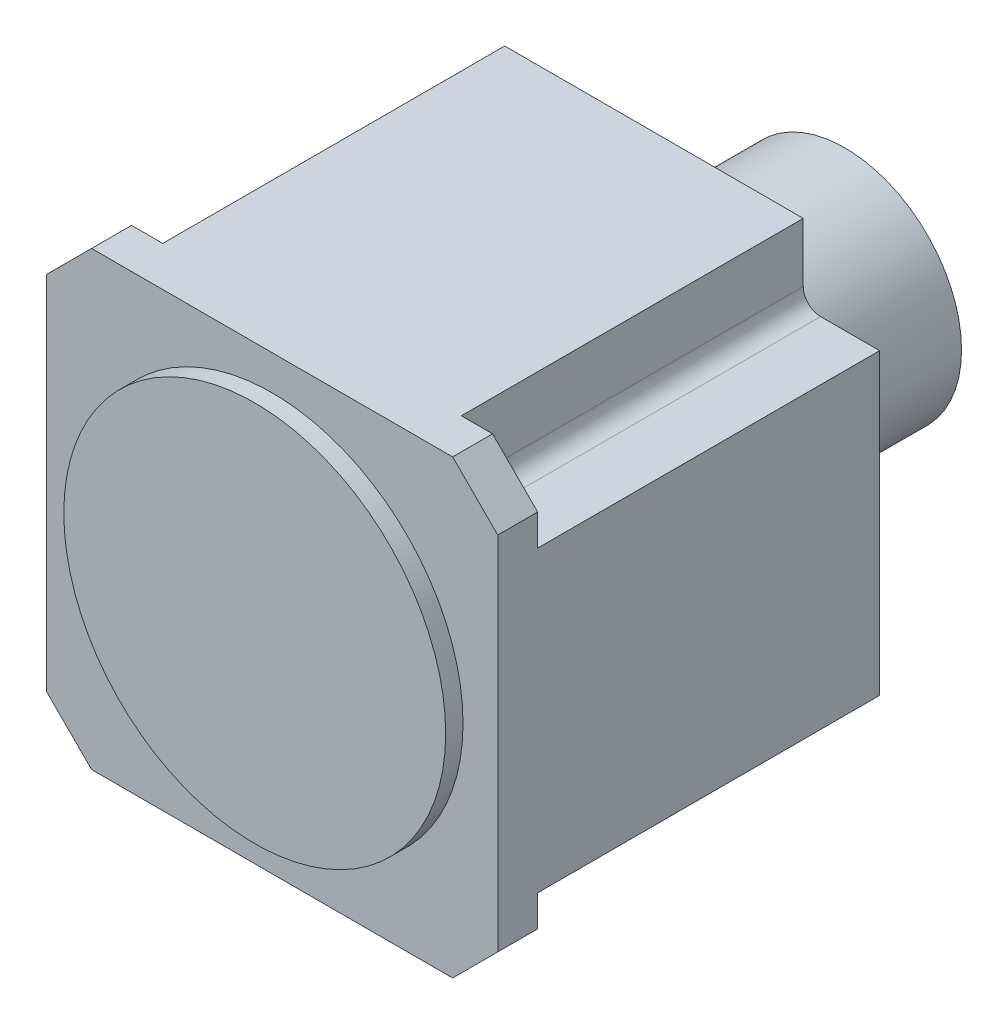
ISO-10303-21;
HEADER;
FILE_DESCRIPTION(('STEP AP214'),'2;1');
FILE_NAME('part.step','',(''),(''),'','','');
FILE_SCHEMA(('AUTOMOTIVE_DESIGN { 1 0 10303 214 1 1 1 1 }'));
ENDSEC;
DATA;
#1=APPLICATION_CONTEXT('core data for automotive mechanical design processes');
#2=APPLICATION_PROTOCOL_DEFINITION('international standard','automotive_design',2000,#1);
#3=PRODUCT_CONTEXT('',#1,'mechanical');
#4=PRODUCT('Part','Part','',(#3));
#5=PRODUCT_RELATED_PRODUCT_CATEGORY('part','',(#4));
#6=PRODUCT_DEFINITION_FORMATION('','',#4);
#7=PRODUCT_DEFINITION_CONTEXT('part definition',#1,'design');
#8=PRODUCT_DEFINITION('design','',#6,#7);
#9=PRODUCT_DEFINITION_SHAPE('','',#8);
#10=(LENGTH_UNIT() NAMED_UNIT(*) SI_UNIT(.MILLI.,.METRE.));
#11=(NAMED_UNIT(*) PLANE_ANGLE_UNIT() SI_UNIT($,.RADIAN.));
#12=(NAMED_UNIT(*) SI_UNIT($,.STERADIAN.) SOLID_ANGLE_UNIT());
#13=UNCERTAINTY_MEASURE_WITH_UNIT(LENGTH_MEASURE(1.E-05),#10,'distance_accuracy_value','');
#14=(GEOMETRIC_REPRESENTATION_CONTEXT(3) GLOBAL_UNCERTAINTY_ASSIGNED_CONTEXT((#13)) GLOBAL_UNIT_ASSIGNED_CONTEXT((#10,
#11,#12)) REPRESENTATION_CONTEXT('',''));
#15=CARTESIAN_POINT('',(0.,0.,0.));
#16=DIRECTION('',(0.,0.,1.));
#17=DIRECTION('',(1.,0.,0.));
#18=AXIS2_PLACEMENT_3D('',#15,#16,#17);
#19=CARTESIAN_POINT('',(0.,0.,0.));
#20=DIRECTION('',(0.,0.,1.));
#21=DIRECTION('',(1.,0.,0.));
#22=AXIS2_PLACEMENT_3D('',#19,#20,#21);
#23=PLANE('',#22);
#24=DIRECTION('',(0.,1.,0.));
#25=VECTOR('',#24,1.);
#26=CARTESIAN_POINT('',(-43.,0.,0.));
#27=LINE('',#26,#25);
#28=CARTESIAN_POINT('',(-43.,48.,0.));
#29=VERTEX_POINT('',#28);
#30=CARTESIAN_POINT('',(-43.,65.,0.));
#31=VERTEX_POINT('',#30);
#32=EDGE_CURVE('E272',#29,#31,#27,.T.);
#33=ORIENTED_EDGE('',*,*,#32,.F.);
#34=CARTESIAN_POINT('',(-48.,48.,0.));
#35=DIRECTION('',(0.,0.,1.));
#36=DIRECTION('',(1.,0.,0.));
#37=AXIS2_PLACEMENT_3D('',#34,#35,#36);
#38=CIRCLE('',#37,5.);
#39=CARTESIAN_POINT('',(-48.,43.,0.));
#40=VERTEX_POINT('',#39);
#41=EDGE_CURVE('E380',#29,#40,#38,.F.);
#42=ORIENTED_EDGE('',*,*,#41,.T.);
#43=DIRECTION('',(1.,0.,0.));
#44=VECTOR('',#43,1.);
#45=CARTESIAN_POINT('',(0.,43.,0.));
#46=LINE('',#45,#44);
#47=CARTESIAN_POINT('',(-65.,43.,0.));
#48=VERTEX_POINT('',#47);
#49=EDGE_CURVE('E269',#48,#40,#46,.T.);
#50=ORIENTED_EDGE('',*,*,#49,.F.);
#51=DIRECTION('',(0.,-1.,0.));
#52=VECTOR('',#51,1.);
#53=CARTESIAN_POINT('',(-65.,0.,0.));
#54=LINE('',#53,#52);
#55=CARTESIAN_POINT('',(-65.,52.,0.));
#56=VERTEX_POINT('',#55);
#57=EDGE_CURVE('E334',#56,#48,#54,.T.);
#58=ORIENTED_EDGE('',*,*,#57,.F.);
#59=DIRECTION('',(0.707106781186548,0.707106781186548,0.));
#60=VECTOR('',#59,1.);
#61=CARTESIAN_POINT('',(-58.5,58.5,0.));
#62=LINE('',#61,#60);
#63=CARTESIAN_POINT('',(-52.,65.,0.));
#64=VERTEX_POINT('',#63);
#65=EDGE_CURVE('E330',#56,#64,#62,.T.);
#66=ORIENTED_EDGE('',*,*,#65,.T.);
#67=DIRECTION('',(-1.,0.,0.));
#68=VECTOR('',#67,1.);
#69=CARTESIAN_POINT('',(0.,65.,0.));
#70=LINE('',#69,#68);
#71=EDGE_CURVE('E326',#31,#64,#70,.T.);
#72=ORIENTED_EDGE('',*,*,#71,.F.);
#73=EDGE_LOOP('',(#33,#42,#50,#58,#66,#72));
#74=FACE_BOUND('',#73,.T.);
#75=ADVANCED_FACE('F41',(#74),#23,.F.);
#76=DIRECTION('',(1.,0.,0.));
#77=VECTOR('',#76,1.);
#78=CARTESIAN_POINT('',(0.,-43.,0.));
#79=LINE('',#78,#77);
#80=CARTESIAN_POINT('',(-65.,-43.,0.));
#81=VERTEX_POINT('',#80);
#82=CARTESIAN_POINT('',(-48.,-43.,0.));
#83=VERTEX_POINT('',#82);
#84=EDGE_CURVE('E266',#81,#83,#79,.T.);
#85=ORIENTED_EDGE('',*,*,#84,.T.);
#86=CARTESIAN_POINT('',(-48.,-48.,0.));
#87=DIRECTION('',(0.,0.,1.));
#88=DIRECTION('',(1.,0.,0.));
#89=AXIS2_PLACEMENT_3D('',#86,#87,#88);
#90=CIRCLE('',#89,5.);
#91=CARTESIAN_POINT('',(-43.,-48.,0.));
#92=VERTEX_POINT('',#91);
#93=EDGE_CURVE('E373',#83,#92,#90,.F.);
#94=ORIENTED_EDGE('',*,*,#93,.T.);
#95=DIRECTION('',(0.,1.,0.));
#96=VECTOR('',#95,1.);
#97=CARTESIAN_POINT('',(-43.,0.,0.));
#98=LINE('',#97,#96);
#99=CARTESIAN_POINT('',(-43.,-65.,0.));
#100=VERTEX_POINT('',#99);
#101=EDGE_CURVE('E263',#100,#92,#98,.T.);
#102=ORIENTED_EDGE('',*,*,#101,.F.);
#103=DIRECTION('',(-1.,0.,0.));
#104=VECTOR('',#103,1.);
#105=CARTESIAN_POINT('',(0.,-65.,0.));
#106=LINE('',#105,#104);
#107=CARTESIAN_POINT('',(-52.0000000000001,-65.,0.));
#108=VERTEX_POINT('',#107);
#109=EDGE_CURVE('E340',#100,#108,#106,.T.);
#110=ORIENTED_EDGE('',*,*,#109,.T.);
#111=DIRECTION('',(-0.707106781186547,0.707106781186548,0.));
#112=VECTOR('',#111,1.);
#113=CARTESIAN_POINT('',(-58.5,-58.5,0.));
#114=LINE('',#113,#112);
#115=CARTESIAN_POINT('',(-65.,-52.0000000000001,0.));
#116=VERTEX_POINT('',#115);
#117=EDGE_CURVE('E337',#108,#116,#114,.T.);
#118=ORIENTED_EDGE('',*,*,#117,.T.);
#119=EDGE_CURVE('E333',#81,#116,#54,.T.);
#120=ORIENTED_EDGE('',*,*,#119,.F.);
#121=EDGE_LOOP('',(#85,#94,#102,#110,#118,#120));
#122=FACE_BOUND('',#121,.T.);
#123=ADVANCED_FACE('F472',(#122),#23,.F.);
#124=DIRECTION('',(0.,1.,0.));
#125=VECTOR('',#124,1.);
#126=CARTESIAN_POINT('',(43.,0.,0.));
#127=LINE('',#126,#125);
#128=CARTESIAN_POINT('',(43.,-65.,0.));
#129=VERTEX_POINT('',#128);
#130=CARTESIAN_POINT('',(43.,-48.,0.));
#131=VERTEX_POINT('',#130);
#132=EDGE_CURVE('E260',#129,#131,#127,.T.);
#133=ORIENTED_EDGE('',*,*,#132,.T.);
#134=CARTESIAN_POINT('',(48.,-48.,0.));
#135=DIRECTION('',(0.,0.,1.));
#136=DIRECTION('',(1.,0.,0.));
#137=AXIS2_PLACEMENT_3D('',#134,#135,#136);
#138=CIRCLE('',#137,5.);
#139=CARTESIAN_POINT('',(48.,-43.,0.));
#140=VERTEX_POINT('',#139);
#141=EDGE_CURVE('E366',#131,#140,#138,.F.);
#142=ORIENTED_EDGE('',*,*,#141,.T.);
#143=DIRECTION('',(1.,0.,0.));
#144=VECTOR('',#143,1.);
#145=CARTESIAN_POINT('',(0.,-43.,0.));
#146=LINE('',#145,#144);
#147=CARTESIAN_POINT('',(65.,-43.,0.));
#148=VERTEX_POINT('',#147);
#149=EDGE_CURVE('E258',#140,#148,#146,.T.);
#150=ORIENTED_EDGE('',*,*,#149,.T.);
#151=DIRECTION('',(0.,-1.,0.));
#152=VECTOR('',#151,1.);
#153=CARTESIAN_POINT('',(65.,0.,0.));
#154=LINE('',#153,#152);
#155=CARTESIAN_POINT('',(65.,-52.,0.));
#156=VERTEX_POINT('',#155);
#157=EDGE_CURVE('E294',#148,#156,#154,.T.);
#158=ORIENTED_EDGE('',*,*,#157,.T.);
#159=DIRECTION('',(0.707106781186548,0.707106781186548,0.));
#160=VECTOR('',#159,1.);
#161=CARTESIAN_POINT('',(58.5,-58.5,0.));
#162=LINE('',#161,#160);
#163=CARTESIAN_POINT('',(52.,-65.,0.));
#164=VERTEX_POINT('',#163);
#165=EDGE_CURVE('E304',#164,#156,#162,.T.);
#166=ORIENTED_EDGE('',*,*,#165,.F.);
#167=EDGE_CURVE('E341',#164,#129,#106,.T.);
#168=ORIENTED_EDGE('',*,*,#167,.T.);
#169=EDGE_LOOP('',(#133,#142,#150,#158,#166,#168));
#170=FACE_BOUND('',#169,.T.);
#171=ADVANCED_FACE('F454',(#170),#23,.F.);
#172=CARTESIAN_POINT('',(65.,0.,11.5));
#173=DIRECTION('',(1.,0.,0.));
#174=DIRECTION('',(0.,1.,0.));
#175=AXIS2_PLACEMENT_3D('',#172,#173,#174);
#176=PLANE('',#175);
#177=CARTESIAN_POINT('',(65.,52.,0.));
#178=VERTEX_POINT('',#177);
#179=CARTESIAN_POINT('',(65.,43.,0.));
#180=VERTEX_POINT('',#179);
#181=EDGE_CURVE('E322',#178,#180,#154,.T.);
#182=ORIENTED_EDGE('',*,*,#181,.F.);
#183=DIRECTION('',(0.,0.,-1.));
#184=VECTOR('',#183,1.);
#185=CARTESIAN_POINT('',(65.,52.,11.5));
#186=LINE('',#185,#184);
#187=CARTESIAN_POINT('',(65.,52.,11.5));
#188=VERTEX_POINT('',#187);
#189=EDGE_CURVE('E299',#188,#178,#186,.T.);
#190=ORIENTED_EDGE('',*,*,#189,.F.);
#191=DIRECTION('',(0.,-1.,0.));
#192=VECTOR('',#191,1.);
#193=CARTESIAN_POINT('',(65.,0.,11.5));
#194=LINE('',#193,#192);
#195=CARTESIAN_POINT('',(65.,-52.,11.5));
#196=VERTEX_POINT('',#195);
#197=EDGE_CURVE('E300',#188,#196,#194,.T.);
#198=ORIENTED_EDGE('',*,*,#197,.T.);
#199=DIRECTION('',(0.,0.,-1.));
#200=VECTOR('',#199,1.);
#201=CARTESIAN_POINT('',(65.,-52.,11.5));
#202=LINE('',#201,#200);
#203=EDGE_CURVE('E321',#196,#156,#202,.T.);
#204=ORIENTED_EDGE('',*,*,#203,.T.);
#205=ORIENTED_EDGE('',*,*,#157,.F.);
#206=DIRECTION('',(0.,0.,1.));
#207=VECTOR('',#206,1.);
#208=CARTESIAN_POINT('',(65.,-43.,-98.5));
#209=LINE('',#208,#207);
#210=CARTESIAN_POINT('',(65.,-43.,-98.5));
#211=VERTEX_POINT('',#210);
#212=EDGE_CURVE('E222',#211,#148,#209,.T.);
#213=ORIENTED_EDGE('',*,*,#212,.F.);
#214=DIRECTION('',(0.,-1.,0.));
#215=VECTOR('',#214,1.);
#216=CARTESIAN_POINT('',(65.,0.,-98.5));
#217=LINE('',#216,#215);
#218=CARTESIAN_POINT('',(65.,43.,-98.5));
#219=VERTEX_POINT('',#218);
#220=EDGE_CURVE('E206',#219,#211,#217,.T.);
#221=ORIENTED_EDGE('',*,*,#220,.F.);
#222=DIRECTION('',(0.,0.,1.));
#223=VECTOR('',#222,1.);
#224=CARTESIAN_POINT('',(65.,43.,-98.5));
#225=LINE('',#224,#223);
#226=EDGE_CURVE('E215',#219,#180,#225,.T.);
#227=ORIENTED_EDGE('',*,*,#226,.T.);
#228=EDGE_LOOP('',(#182,#190,#198,#204,#205,#213,#221,#227));
#229=FACE_BOUND('',#228,.T.);
#230=ADVANCED_FACE('F224',(#229),#176,.T.);
#231=CARTESIAN_POINT('',(58.5,58.5,11.5));
#232=DIRECTION('',(-0.707106781186547,-0.707106781186547,0.));
#233=DIRECTION('',(0.707106781186548,-0.707106781186548,0.));
#234=AXIS2_PLACEMENT_3D('',#231,#232,#233);
#235=PLANE('',#234);
#236=DIRECTION('',(-0.707106781186548,0.707106781186548,0.));
#237=VECTOR('',#236,1.);
#238=CARTESIAN_POINT('',(58.5,58.5,0.));
#239=LINE('',#238,#237);
#240=CARTESIAN_POINT('',(52.,65.,0.));
#241=VERTEX_POINT('',#240);
#242=EDGE_CURVE('E324',#178,#241,#239,.T.);
#243=ORIENTED_EDGE('',*,*,#242,.T.);
#244=DIRECTION('',(0.,0.,-1.));
#245=VECTOR('',#244,1.);
#246=CARTESIAN_POINT('',(52.,65.,11.5));
#247=LINE('',#246,#245);
#248=CARTESIAN_POINT('',(52.,65.,11.5));
#249=VERTEX_POINT('',#248);
#250=EDGE_CURVE('E360',#249,#241,#247,.T.);
#251=ORIENTED_EDGE('',*,*,#250,.F.);
#252=DIRECTION('',(-0.707106781186548,0.707106781186548,0.));
#253=VECTOR('',#252,1.);
#254=CARTESIAN_POINT('',(58.5,58.5,11.5));
#255=LINE('',#254,#253);
#256=EDGE_CURVE('E303',#188,#249,#255,.T.);
#257=ORIENTED_EDGE('',*,*,#256,.F.);
#258=ORIENTED_EDGE('',*,*,#189,.T.);
#259=EDGE_LOOP('',(#243,#251,#257,#258));
#260=FACE_BOUND('',#259,.T.);
#261=ADVANCED_FACE('F431',(#260),#235,.F.);
#262=CARTESIAN_POINT('',(0.,65.,11.5));
#263=DIRECTION('',(0.,-1.,0.));
#264=DIRECTION('',(1.,0.,0.));
#265=AXIS2_PLACEMENT_3D('',#262,#263,#264);
#266=PLANE('',#265);
#267=CARTESIAN_POINT('',(43.,65.,0.));
#268=VERTEX_POINT('',#267);
#269=EDGE_CURVE('E327',#241,#268,#70,.T.);
#270=ORIENTED_EDGE('',*,*,#269,.T.);
#271=DIRECTION('',(0.,0.,1.));
#272=VECTOR('',#271,1.);
#273=CARTESIAN_POINT('',(43.,65.,-98.5));
#274=LINE('',#273,#272);
#275=CARTESIAN_POINT('',(43.,65.,-98.5));
#276=VERTEX_POINT('',#275);
#277=EDGE_CURVE('E253',#276,#268,#274,.T.);
#278=ORIENTED_EDGE('',*,*,#277,.F.);
#279=DIRECTION('',(1.,0.,0.));
#280=VECTOR('',#279,1.);
#281=CARTESIAN_POINT('',(0.,65.,-98.5));
#282=LINE('',#281,#280);
#283=CARTESIAN_POINT('',(-43.,65.,-98.5));
#284=VERTEX_POINT('',#283);
#285=EDGE_CURVE('E250',#284,#276,#282,.T.);
#286=ORIENTED_EDGE('',*,*,#285,.F.);
#287=DIRECTION('',(0.,0.,1.));
#288=VECTOR('',#287,1.);
#289=CARTESIAN_POINT('',(-43.,65.,-98.5));
#290=LINE('',#289,#288);
#291=EDGE_CURVE('E276',#284,#31,#290,.T.);
#292=ORIENTED_EDGE('',*,*,#291,.T.);
#293=ORIENTED_EDGE('',*,*,#71,.T.);
#294=DIRECTION('',(0.,0.,-1.));
#295=VECTOR('',#294,1.);
#296=CARTESIAN_POINT('',(-52.,65.,11.5));
#297=LINE('',#296,#295);
#298=CARTESIAN_POINT('',(-52.,65.,11.5));
#299=VERTEX_POINT('',#298);
#300=EDGE_CURVE('E357',#299,#64,#297,.T.);
#301=ORIENTED_EDGE('',*,*,#300,.F.);
#302=DIRECTION('',(-1.,0.,0.));
#303=VECTOR('',#302,1.);
#304=CARTESIAN_POINT('',(0.,65.,11.5));
#305=LINE('',#304,#303);
#306=EDGE_CURVE('E306',#249,#299,#305,.T.);
#307=ORIENTED_EDGE('',*,*,#306,.F.);
#308=ORIENTED_EDGE('',*,*,#250,.T.);
#309=EDGE_LOOP('',(#270,#278,#286,#292,#293,#301,#307,#308));
#310=FACE_BOUND('',#309,.T.);
#311=ADVANCED_FACE('F421',(#310),#266,.F.);
#312=CARTESIAN_POINT('',(-58.5,58.5,11.5));
#313=DIRECTION('',(-0.707106781186547,0.707106781186547,0.));
#314=DIRECTION('',(-0.707106781186548,-0.707106781186548,0.));
#315=AXIS2_PLACEMENT_3D('',#312,#313,#314);
#316=PLANE('',#315);
#317=ORIENTED_EDGE('',*,*,#65,.F.);
#318=DIRECTION('',(0.,0.,-1.));
#319=VECTOR('',#318,1.);
#320=CARTESIAN_POINT('',(-65.,52.,11.5));
#321=LINE('',#320,#319);
#322=CARTESIAN_POINT('',(-65.,52.,11.5));
#323=VERTEX_POINT('',#322);
#324=EDGE_CURVE('E355',#323,#56,#321,.T.);
#325=ORIENTED_EDGE('',*,*,#324,.F.);
#326=DIRECTION('',(0.707106781186548,0.707106781186548,0.));
#327=VECTOR('',#326,1.);
#328=CARTESIAN_POINT('',(-58.5,58.5,11.5));
#329=LINE('',#328,#327);
#330=EDGE_CURVE('E308',#323,#299,#329,.T.);
#331=ORIENTED_EDGE('',*,*,#330,.T.);
#332=ORIENTED_EDGE('',*,*,#300,.T.);
#333=EDGE_LOOP('',(#317,#325,#331,#332));
#334=FACE_BOUND('',#333,.T.);
#335=ADVANCED_FACE('F416',(#334),#316,.T.);
#336=CARTESIAN_POINT('',(-65.,0.,11.5));
#337=DIRECTION('',(1.,0.,0.));
#338=DIRECTION('',(0.,0.,-1.));
#339=AXIS2_PLACEMENT_3D('',#336,#337,#338);
#340=PLANE('',#339);
#341=ORIENTED_EDGE('',*,*,#57,.T.);
#342=DIRECTION('',(0.,0.,1.));
#343=VECTOR('',#342,1.);
#344=CARTESIAN_POINT('',(-65.,43.,-98.5));
#345=LINE('',#344,#343);
#346=CARTESIAN_POINT('',(-65.,43.,-98.5));
#347=VERTEX_POINT('',#346);
#348=EDGE_CURVE('E279',#347,#48,#345,.T.);
#349=ORIENTED_EDGE('',*,*,#348,.F.);
#350=DIRECTION('',(0.,1.,0.));
#351=VECTOR('',#350,1.);
#352=CARTESIAN_POINT('',(-65.,0.,-98.5));
#353=LINE('',#352,#351);
#354=CARTESIAN_POINT('',(-65.,-43.,-98.5));
#355=VERTEX_POINT('',#354);
#356=EDGE_CURVE('E243',#355,#347,#353,.T.);
#357=ORIENTED_EDGE('',*,*,#356,.F.);
#358=DIRECTION('',(0.,0.,1.));
#359=VECTOR('',#358,1.);
#360=CARTESIAN_POINT('',(-65.,-43.,-98.5));
#361=LINE('',#360,#359);
#362=EDGE_CURVE('E282',#355,#81,#361,.T.);
#363=ORIENTED_EDGE('',*,*,#362,.T.);
#364=ORIENTED_EDGE('',*,*,#119,.T.);
#365=DIRECTION('',(0.,0.,-1.));
#366=VECTOR('',#365,1.);
#367=CARTESIAN_POINT('',(-65.,-52.0000000000001,11.5));
#368=LINE('',#367,#366);
#369=CARTESIAN_POINT('',(-65.,-52.0000000000001,11.5));
#370=VERTEX_POINT('',#369);
#371=EDGE_CURVE('E352',#370,#116,#368,.T.);
#372=ORIENTED_EDGE('',*,*,#371,.F.);
#373=DIRECTION('',(0.,-1.,0.));
#374=VECTOR('',#373,1.);
#375=CARTESIAN_POINT('',(-65.,0.,11.5));
#376=LINE('',#375,#374);
#377=EDGE_CURVE('E311',#323,#370,#376,.T.);
#378=ORIENTED_EDGE('',*,*,#377,.F.);
#379=ORIENTED_EDGE('',*,*,#324,.T.);
#380=EDGE_LOOP('',(#341,#349,#357,#363,#364,#372,#378,#379));
#381=FACE_BOUND('',#380,.T.);
#382=ADVANCED_FACE('F411',(#381),#340,.F.);
#383=CARTESIAN_POINT('',(-58.5,-58.5,11.5));
#384=DIRECTION('',(-0.707106781186548,-0.707106781186547,0.));
#385=DIRECTION('',(0.707106781186547,-0.707106781186548,0.));
#386=AXIS2_PLACEMENT_3D('',#383,#384,#385);
#387=PLANE('',#386);
#388=ORIENTED_EDGE('',*,*,#117,.F.);
#389=DIRECTION('',(0.,0.,-1.));
#390=VECTOR('',#389,1.);
#391=CARTESIAN_POINT('',(-52.0000000000001,-65.,11.5));
#392=LINE('',#391,#390);
#393=CARTESIAN_POINT('',(-52.0000000000001,-65.,11.5));
#394=VERTEX_POINT('',#393);
#395=EDGE_CURVE('E349',#394,#108,#392,.T.);
#396=ORIENTED_EDGE('',*,*,#395,.F.);
#397=DIRECTION('',(-0.707106781186547,0.707106781186548,0.));
#398=VECTOR('',#397,1.);
#399=CARTESIAN_POINT('',(-58.5,-58.5,11.5));
#400=LINE('',#399,#398);
#401=EDGE_CURVE('E313',#394,#370,#400,.T.);
#402=ORIENTED_EDGE('',*,*,#401,.T.);
#403=ORIENTED_EDGE('',*,*,#371,.T.);
#404=EDGE_LOOP('',(#388,#396,#402,#403));
#405=FACE_BOUND('',#404,.T.);
#406=ADVANCED_FACE('F476',(#405),#387,.T.);
#407=CARTESIAN_POINT('',(0.,-65.,11.5));
#408=DIRECTION('',(0.,-1.,0.));
#409=DIRECTION('',(1.,0.,0.));
#410=AXIS2_PLACEMENT_3D('',#407,#408,#409);
#411=PLANE('',#410);
#412=ORIENTED_EDGE('',*,*,#167,.F.);
#413=DIRECTION('',(0.,0.,-1.));
#414=VECTOR('',#413,1.);
#415=CARTESIAN_POINT('',(52.,-65.,11.5));
#416=LINE('',#415,#414);
#417=CARTESIAN_POINT('',(52.,-65.,11.5));
#418=VERTEX_POINT('',#417);
#419=EDGE_CURVE('E347',#418,#164,#416,.T.);
#420=ORIENTED_EDGE('',*,*,#419,.F.);
#421=DIRECTION('',(-1.,0.,0.));
#422=VECTOR('',#421,1.);
#423=CARTESIAN_POINT('',(0.,-65.,11.5));
#424=LINE('',#423,#422);
#425=EDGE_CURVE('E316',#418,#394,#424,.T.);
#426=ORIENTED_EDGE('',*,*,#425,.T.);
#427=ORIENTED_EDGE('',*,*,#395,.T.);
#428=ORIENTED_EDGE('',*,*,#109,.F.);
#429=DIRECTION('',(0.,0.,1.));
#430=VECTOR('',#429,1.);
#431=CARTESIAN_POINT('',(-43.,-65.,-98.5));
#432=LINE('',#431,#430);
#433=CARTESIAN_POINT('',(-43.,-65.,-98.5));
#434=VERTEX_POINT('',#433);
#435=EDGE_CURVE('E285',#434,#100,#432,.T.);
#436=ORIENTED_EDGE('',*,*,#435,.F.);
#437=DIRECTION('',(-1.,0.,0.));
#438=VECTOR('',#437,1.);
#439=CARTESIAN_POINT('',(0.,-65.,-98.5));
#440=LINE('',#439,#438);
#441=CARTESIAN_POINT('',(43.,-65.,-98.5));
#442=VERTEX_POINT('',#441);
#443=EDGE_CURVE('E235',#442,#434,#440,.T.);
#444=ORIENTED_EDGE('',*,*,#443,.F.);
#445=DIRECTION('',(0.,0.,1.));
#446=VECTOR('',#445,1.);
#447=CARTESIAN_POINT('',(43.,-65.,-98.5));
#448=LINE('',#447,#446);
#449=EDGE_CURVE('E288',#442,#129,#448,.T.);
#450=ORIENTED_EDGE('',*,*,#449,.T.);
#451=EDGE_LOOP('',(#412,#420,#426,#427,#428,#436,#444,#450));
#452=FACE_BOUND('',#451,.T.);
#453=ADVANCED_FACE('F458',(#452),#411,.T.);
#454=CARTESIAN_POINT('',(58.5,-58.5,11.5));
#455=DIRECTION('',(-0.707106781186547,0.707106781186547,0.));
#456=DIRECTION('',(-0.707106781186548,-0.707106781186548,0.));
#457=AXIS2_PLACEMENT_3D('',#454,#455,#456);
#458=PLANE('',#457);
#459=ORIENTED_EDGE('',*,*,#165,.T.);
#460=ORIENTED_EDGE('',*,*,#203,.F.);
#461=DIRECTION('',(0.707106781186548,0.707106781186548,0.));
#462=VECTOR('',#461,1.);
#463=CARTESIAN_POINT('',(58.5,-58.5,11.5));
#464=LINE('',#463,#462);
#465=EDGE_CURVE('E319',#418,#196,#464,.T.);
#466=ORIENTED_EDGE('',*,*,#465,.F.);
#467=ORIENTED_EDGE('',*,*,#419,.T.);
#468=EDGE_LOOP('',(#459,#460,#466,#467));
#469=FACE_BOUND('',#468,.T.);
#470=ADVANCED_FACE('F439',(#469),#458,.F.);
#471=CARTESIAN_POINT('',(0.,0.,11.5));
#472=DIRECTION('',(0.,0.,1.));
#473=DIRECTION('',(1.,0.,0.));
#474=AXIS2_PLACEMENT_3D('',#471,#472,#473);
#475=PLANE('',#474);
#476=CARTESIAN_POINT('',(0.,0.,11.5));
#477=DIRECTION('',(0.,0.,1.));
#478=DIRECTION('',(1.,0.,0.));
#479=AXIS2_PLACEMENT_3D('',#476,#477,#478);
#480=CIRCLE('',#479,55.);
#481=CARTESIAN_POINT('',(55.,0.,11.5));
#482=VERTEX_POINT('',#481);
#483=EDGE_CURVE('E295',#482,#482,#480,.T.);
#484=ORIENTED_EDGE('',*,*,#483,.F.);
#485=EDGE_LOOP('',(#484));
#486=FACE_BOUND('',#485,.T.);
#487=ORIENTED_EDGE('',*,*,#197,.F.);
#488=ORIENTED_EDGE('',*,*,#256,.T.);
#489=ORIENTED_EDGE('',*,*,#306,.T.);
#490=ORIENTED_EDGE('',*,*,#330,.F.);
#491=ORIENTED_EDGE('',*,*,#377,.T.);
#492=ORIENTED_EDGE('',*,*,#401,.F.);
#493=ORIENTED_EDGE('',*,*,#425,.F.);
#494=ORIENTED_EDGE('',*,*,#465,.T.);
#495=EDGE_LOOP('',(#487,#488,#489,#490,#491,#492,#493,#494));
#496=FACE_BOUND('',#495,.T.);
#497=ADVANCED_FACE('F433',(#486,#496),#475,.T.);
#498=DIRECTION('',(1.,0.,0.));
#499=VECTOR('',#498,1.);
#500=CARTESIAN_POINT('',(0.,43.,0.));
#501=LINE('',#500,#499);
#502=CARTESIAN_POINT('',(48.,43.,0.));
#503=VERTEX_POINT('',#502);
#504=EDGE_CURVE('E217',#503,#180,#501,.T.);
#505=ORIENTED_EDGE('',*,*,#504,.F.);
#506=CARTESIAN_POINT('',(48.,48.,0.));
#507=DIRECTION('',(0.,0.,1.));
#508=DIRECTION('',(1.,0.,0.));
#509=AXIS2_PLACEMENT_3D('',#506,#507,#508);
#510=CIRCLE('',#509,5.);
#511=CARTESIAN_POINT('',(43.,48.,0.));
#512=VERTEX_POINT('',#511);
#513=EDGE_CURVE('E64',#503,#512,#510,.F.);
#514=ORIENTED_EDGE('',*,*,#513,.T.);
#515=DIRECTION('',(0.,1.,0.));
#516=VECTOR('',#515,1.);
#517=CARTESIAN_POINT('',(43.,0.,0.));
#518=LINE('',#517,#516);
#519=EDGE_CURVE('E254',#512,#268,#518,.T.);
#520=ORIENTED_EDGE('',*,*,#519,.T.);
#521=ORIENTED_EDGE('',*,*,#269,.F.);
#522=ORIENTED_EDGE('',*,*,#242,.F.);
#523=ORIENTED_EDGE('',*,*,#181,.T.);
#524=EDGE_LOOP('',(#505,#514,#520,#521,#522,#523));
#525=FACE_BOUND('',#524,.T.);
#526=ADVANCED_FACE('F424',(#525),#23,.F.);
#527=CARTESIAN_POINT('',(0.,0.,16.5));
#528=DIRECTION('',(0.,0.,-1.));
#529=DIRECTION('',(-1.,0.,0.));
#530=AXIS2_PLACEMENT_3D('',#527,#528,#529);
#531=CYLINDRICAL_SURFACE('',#530,55.);
#532=CARTESIAN_POINT('',(0.,0.,16.5));
#533=DIRECTION('',(0.,0.,1.));
#534=DIRECTION('',(1.,0.,0.));
#535=AXIS2_PLACEMENT_3D('',#532,#533,#534);
#536=CIRCLE('',#535,55.);
#537=CARTESIAN_POINT('',(55.,0.,16.5));
#538=VERTEX_POINT('',#537);
#539=EDGE_CURVE('E221',#538,#538,#536,.T.);
#540=ORIENTED_EDGE('',*,*,#539,.F.);
#541=EDGE_LOOP('',(#540));
#542=FACE_BOUND('',#541,.T.);
#543=ORIENTED_EDGE('',*,*,#483,.T.);
#544=EDGE_LOOP('',(#543));
#545=FACE_BOUND('',#544,.T.);
#546=ADVANCED_FACE('F494',(#542,#545),#531,.T.);
#547=CARTESIAN_POINT('',(0.,0.,16.5));
#548=DIRECTION('',(0.,0.,1.));
#549=DIRECTION('',(1.,0.,0.));
#550=AXIS2_PLACEMENT_3D('',#547,#548,#549);
#551=PLANE('',#550);
#552=ORIENTED_EDGE('',*,*,#539,.T.);
#553=EDGE_LOOP('',(#552));
#554=FACE_BOUND('',#553,.T.);
#555=ADVANCED_FACE('F499',(#554),#551,.T.);
#556=CARTESIAN_POINT('',(43.,0.,-98.5));
#557=DIRECTION('',(1.,0.,0.));
#558=DIRECTION('',(0.,1.,0.));
#559=AXIS2_PLACEMENT_3D('',#556,#557,#558);
#560=PLANE('',#559);
#561=ORIENTED_EDGE('',*,*,#519,.F.);
#562=DIRECTION('',(0.,0.,1.));
#563=VECTOR('',#562,1.);
#564=CARTESIAN_POINT('',(43.,48.,-98.5));
#565=LINE('',#564,#563);
#566=CARTESIAN_POINT('',(43.,48.,-98.5));
#567=VERTEX_POINT('',#566);
#568=EDGE_CURVE('E56',#512,#567,#565,.F.);
#569=ORIENTED_EDGE('',*,*,#568,.T.);
#570=DIRECTION('',(0.,1.,0.));
#571=VECTOR('',#570,1.);
#572=CARTESIAN_POINT('',(43.,0.,-98.5));
#573=LINE('',#572,#571);
#574=EDGE_CURVE('E212',#567,#276,#573,.T.);
#575=ORIENTED_EDGE('',*,*,#574,.T.);
#576=ORIENTED_EDGE('',*,*,#277,.T.);
#577=EDGE_LOOP('',(#561,#569,#575,#576));
#578=FACE_BOUND('',#577,.T.);
#579=ADVANCED_FACE('F627',(#578),#560,.T.);
#580=CARTESIAN_POINT('',(0.,43.,-98.5));
#581=DIRECTION('',(0.,-1.,0.));
#582=DIRECTION('',(0.,0.,-1.));
#583=AXIS2_PLACEMENT_3D('',#580,#581,#582);
#584=PLANE('',#583);
#585=DIRECTION('',(1.,0.,0.));
#586=VECTOR('',#585,1.);
#587=CARTESIAN_POINT('',(0.,43.,-98.5));
#588=LINE('',#587,#586);
#589=CARTESIAN_POINT('',(48.,43.,-98.5));
#590=VERTEX_POINT('',#589);
#591=EDGE_CURVE('E201',#590,#219,#588,.T.);
#592=ORIENTED_EDGE('',*,*,#591,.F.);
#593=DIRECTION('',(0.,0.,1.));
#594=VECTOR('',#593,1.);
#595=CARTESIAN_POINT('',(48.,43.,-98.5));
#596=LINE('',#595,#594);
#597=EDGE_CURVE('E384',#590,#503,#596,.T.);
#598=ORIENTED_EDGE('',*,*,#597,.T.);
#599=ORIENTED_EDGE('',*,*,#504,.T.);
#600=ORIENTED_EDGE('',*,*,#226,.F.);
#601=EDGE_LOOP('',(#592,#598,#599,#600));
#602=FACE_BOUND('',#601,.T.);
#603=ADVANCED_FACE('F216',(#602),#584,.F.);
#604=CARTESIAN_POINT('',(0.,-43.,-98.5));
#605=DIRECTION('',(0.,-1.,0.));
#606=DIRECTION('',(0.,0.,-1.));
#607=AXIS2_PLACEMENT_3D('',#604,#605,#606);
#608=PLANE('',#607);
#609=ORIENTED_EDGE('',*,*,#149,.F.);
#610=DIRECTION('',(0.,0.,1.));
#611=VECTOR('',#610,1.);
#612=CARTESIAN_POINT('',(48.,-43.,-98.5));
#613=LINE('',#612,#611);
#614=CARTESIAN_POINT('',(48.,-43.,-98.5));
#615=VERTEX_POINT('',#614);
#616=EDGE_CURVE('E368',#140,#615,#613,.F.);
#617=ORIENTED_EDGE('',*,*,#616,.T.);
#618=DIRECTION('',(1.,0.,0.));
#619=VECTOR('',#618,1.);
#620=CARTESIAN_POINT('',(0.,-43.,-98.5));
#621=LINE('',#620,#619);
#622=EDGE_CURVE('E227',#615,#211,#621,.T.);
#623=ORIENTED_EDGE('',*,*,#622,.T.);
#624=ORIENTED_EDGE('',*,*,#212,.T.);
#625=EDGE_LOOP('',(#609,#617,#623,#624));
#626=FACE_BOUND('',#625,.T.);
#627=ADVANCED_FACE('F444',(#626),#608,.T.);
#628=CARTESIAN_POINT('',(43.,0.,-98.5));
#629=DIRECTION('',(1.,0.,0.));
#630=DIRECTION('',(0.,1.,0.));
#631=AXIS2_PLACEMENT_3D('',#628,#629,#630);
#632=PLANE('',#631);
#633=DIRECTION('',(0.,1.,0.));
#634=VECTOR('',#633,1.);
#635=CARTESIAN_POINT('',(43.,0.,-98.5));
#636=LINE('',#635,#634);
#637=CARTESIAN_POINT('',(43.,-48.,-98.5));
#638=VERTEX_POINT('',#637);
#639=EDGE_CURVE('E229',#442,#638,#636,.T.);
#640=ORIENTED_EDGE('',*,*,#639,.T.);
#641=DIRECTION('',(0.,0.,1.));
#642=VECTOR('',#641,1.);
#643=CARTESIAN_POINT('',(43.,-48.,0.));
#644=LINE('',#643,#642);
#645=EDGE_CURVE('E298',#638,#131,#644,.T.);
#646=ORIENTED_EDGE('',*,*,#645,.T.);
#647=ORIENTED_EDGE('',*,*,#132,.F.);
#648=ORIENTED_EDGE('',*,*,#449,.F.);
#649=EDGE_LOOP('',(#640,#646,#647,#648));
#650=FACE_BOUND('',#649,.T.);
#651=ADVANCED_FACE('F453',(#650),#632,.T.);
#652=CARTESIAN_POINT('',(-43.,0.,-98.5));
#653=DIRECTION('',(1.,0.,0.));
#654=DIRECTION('',(0.,1.,0.));
#655=AXIS2_PLACEMENT_3D('',#652,#653,#654);
#656=PLANE('',#655);
#657=ORIENTED_EDGE('',*,*,#101,.T.);
#658=DIRECTION('',(0.,0.,1.));
#659=VECTOR('',#658,1.);
#660=CARTESIAN_POINT('',(-43.,-48.,-98.5));
#661=LINE('',#660,#659);
#662=CARTESIAN_POINT('',(-43.,-48.,-98.5));
#663=VERTEX_POINT('',#662);
#664=EDGE_CURVE('E375',#92,#663,#661,.F.);
#665=ORIENTED_EDGE('',*,*,#664,.T.);
#666=DIRECTION('',(0.,1.,0.));
#667=VECTOR('',#666,1.);
#668=CARTESIAN_POINT('',(-43.,0.,-98.5));
#669=LINE('',#668,#667);
#670=EDGE_CURVE('E237',#434,#663,#669,.T.);
#671=ORIENTED_EDGE('',*,*,#670,.F.);
#672=ORIENTED_EDGE('',*,*,#435,.T.);
#673=EDGE_LOOP('',(#657,#665,#671,#672));
#674=FACE_BOUND('',#673,.T.);
#675=ADVANCED_FACE('F477',(#674),#656,.F.);
#676=CARTESIAN_POINT('',(0.,-43.,-98.5));
#677=DIRECTION('',(0.,-1.,0.));
#678=DIRECTION('',(0.,0.,-1.));
#679=AXIS2_PLACEMENT_3D('',#676,#677,#678);
#680=PLANE('',#679);
#681=DIRECTION('',(1.,0.,0.));
#682=VECTOR('',#681,1.);
#683=CARTESIAN_POINT('',(0.,-43.,-98.5));
#684=LINE('',#683,#682);
#685=CARTESIAN_POINT('',(-48.,-43.,-98.5));
#686=VERTEX_POINT('',#685);
#687=EDGE_CURVE('E240',#355,#686,#684,.T.);
#688=ORIENTED_EDGE('',*,*,#687,.T.);
#689=DIRECTION('',(0.,0.,1.));
#690=VECTOR('',#689,1.);
#691=CARTESIAN_POINT('',(-48.,-43.,-98.5));
#692=LINE('',#691,#690);
#693=EDGE_CURVE('E370',#686,#83,#692,.T.);
#694=ORIENTED_EDGE('',*,*,#693,.T.);
#695=ORIENTED_EDGE('',*,*,#84,.F.);
#696=ORIENTED_EDGE('',*,*,#362,.F.);
#697=EDGE_LOOP('',(#688,#694,#695,#696));
#698=FACE_BOUND('',#697,.T.);
#699=ADVANCED_FACE('F470',(#698),#680,.T.);
#700=CARTESIAN_POINT('',(0.,43.,-98.5));
#701=DIRECTION('',(0.,-1.,0.));
#702=DIRECTION('',(0.,0.,-1.));
#703=AXIS2_PLACEMENT_3D('',#700,#701,#702);
#704=PLANE('',#703);
#705=ORIENTED_EDGE('',*,*,#49,.T.);
#706=DIRECTION('',(0.,0.,1.));
#707=VECTOR('',#706,1.);
#708=CARTESIAN_POINT('',(-48.,43.,-98.5));
#709=LINE('',#708,#707);
#710=CARTESIAN_POINT('',(-48.,43.,-98.5));
#711=VERTEX_POINT('',#710);
#712=EDGE_CURVE('E382',#40,#711,#709,.F.);
#713=ORIENTED_EDGE('',*,*,#712,.T.);
#714=DIRECTION('',(1.,0.,0.));
#715=VECTOR('',#714,1.);
#716=CARTESIAN_POINT('',(0.,43.,-98.5));
#717=LINE('',#716,#715);
#718=EDGE_CURVE('E245',#347,#711,#717,.T.);
#719=ORIENTED_EDGE('',*,*,#718,.F.);
#720=ORIENTED_EDGE('',*,*,#348,.T.);
#721=EDGE_LOOP('',(#705,#713,#719,#720));
#722=FACE_BOUND('',#721,.T.);
#723=ADVANCED_FACE('F407',(#722),#704,.F.);
#724=CARTESIAN_POINT('',(-43.,0.,-98.5));
#725=DIRECTION('',(1.,0.,0.));
#726=DIRECTION('',(0.,1.,0.));
#727=AXIS2_PLACEMENT_3D('',#724,#725,#726);
#728=PLANE('',#727);
#729=DIRECTION('',(0.,1.,0.));
#730=VECTOR('',#729,1.);
#731=CARTESIAN_POINT('',(-43.,0.,-98.5));
#732=LINE('',#731,#730);
#733=CARTESIAN_POINT('',(-43.,48.,-98.5));
#734=VERTEX_POINT('',#733);
#735=EDGE_CURVE('E248',#734,#284,#732,.T.);
#736=ORIENTED_EDGE('',*,*,#735,.F.);
#737=DIRECTION('',(0.,0.,1.));
#738=VECTOR('',#737,1.);
#739=CARTESIAN_POINT('',(-43.,48.,0.));
#740=LINE('',#739,#738);
#741=EDGE_CURVE('E377',#734,#29,#740,.T.);
#742=ORIENTED_EDGE('',*,*,#741,.T.);
#743=ORIENTED_EDGE('',*,*,#32,.T.);
#744=ORIENTED_EDGE('',*,*,#291,.F.);
#745=EDGE_LOOP('',(#736,#742,#743,#744));
#746=FACE_BOUND('',#745,.T.);
#747=ADVANCED_FACE('F399',(#746),#728,.F.);
#748=CARTESIAN_POINT('',(0.,0.,-98.5));
#749=DIRECTION('',(0.,0.,-1.));
#750=DIRECTION('',(-1.,0.,0.));
#751=AXIS2_PLACEMENT_3D('',#748,#749,#750);
#752=PLANE('',#751);
#753=CARTESIAN_POINT('',(0.,0.,-98.5));
#754=DIRECTION('',(0.,0.,-1.));
#755=DIRECTION('',(-1.,0.,0.));
#756=AXIS2_PLACEMENT_3D('',#753,#754,#755);
#757=CIRCLE('',#756,33.6);
#758=CARTESIAN_POINT('',(-33.6,0.,-98.5));
#759=VERTEX_POINT('',#758);
#760=EDGE_CURVE('E764',#759,#759,#757,.T.);
#761=ORIENTED_EDGE('',*,*,#760,.F.);
#762=EDGE_LOOP('',(#761));
#763=FACE_BOUND('',#762,.T.);
#764=ORIENTED_EDGE('',*,*,#574,.F.);
#765=CARTESIAN_POINT('',(48.,48.,-98.5));
#766=DIRECTION('',(0.,0.,-1.));
#767=DIRECTION('',(-1.,0.,0.));
#768=AXIS2_PLACEMENT_3D('',#765,#766,#767);
#769=CIRCLE('',#768,5.);
#770=EDGE_CURVE('E11',#567,#590,#769,.F.);
#771=ORIENTED_EDGE('',*,*,#770,.T.);
#772=ORIENTED_EDGE('',*,*,#591,.T.);
#773=ORIENTED_EDGE('',*,*,#220,.T.);
#774=ORIENTED_EDGE('',*,*,#622,.F.);
#775=CARTESIAN_POINT('',(48.,-48.,-98.5));
#776=DIRECTION('',(0.,0.,-1.));
#777=DIRECTION('',(-1.,0.,0.));
#778=AXIS2_PLACEMENT_3D('',#775,#776,#777);
#779=CIRCLE('',#778,5.);
#780=EDGE_CURVE('E388',#615,#638,#779,.F.);
#781=ORIENTED_EDGE('',*,*,#780,.T.);
#782=ORIENTED_EDGE('',*,*,#639,.F.);
#783=ORIENTED_EDGE('',*,*,#443,.T.);
#784=ORIENTED_EDGE('',*,*,#670,.T.);
#785=CARTESIAN_POINT('',(-48.,-48.,-98.5));
#786=DIRECTION('',(0.,0.,-1.));
#787=DIRECTION('',(-1.,0.,0.));
#788=AXIS2_PLACEMENT_3D('',#785,#786,#787);
#789=CIRCLE('',#788,5.);
#790=EDGE_CURVE('E390',#663,#686,#789,.F.);
#791=ORIENTED_EDGE('',*,*,#790,.T.);
#792=ORIENTED_EDGE('',*,*,#687,.F.);
#793=ORIENTED_EDGE('',*,*,#356,.T.);
#794=ORIENTED_EDGE('',*,*,#718,.T.);
#795=CARTESIAN_POINT('',(-48.,48.,-98.5));
#796=DIRECTION('',(0.,0.,-1.));
#797=DIRECTION('',(-1.,0.,0.));
#798=AXIS2_PLACEMENT_3D('',#795,#796,#797);
#799=CIRCLE('',#798,5.);
#800=EDGE_CURVE('E49',#711,#734,#799,.F.);
#801=ORIENTED_EDGE('',*,*,#800,.T.);
#802=ORIENTED_EDGE('',*,*,#735,.T.);
#803=ORIENTED_EDGE('',*,*,#285,.T.);
#804=EDGE_LOOP('',(#764,#771,#772,#773,#774,#781,#782,#783,#784,#791,#792,#793,#794,#801,#802,#803));
#805=FACE_BOUND('',#804,.T.);
#806=ADVANCED_FACE('F203',(#763,#805),#752,.T.);
#807=CARTESIAN_POINT('',(48.,-48.,-98.5));
#808=DIRECTION('',(0.,0.,-1.));
#809=DIRECTION('',(-1.,0.,0.));
#810=AXIS2_PLACEMENT_3D('',#807,#808,#809);
#811=CYLINDRICAL_SURFACE('',#810,5.);
#812=ORIENTED_EDGE('',*,*,#780,.F.);
#813=ORIENTED_EDGE('',*,*,#616,.F.);
#814=ORIENTED_EDGE('',*,*,#141,.F.);
#815=ORIENTED_EDGE('',*,*,#645,.F.);
#816=EDGE_LOOP('',(#812,#813,#814,#815));
#817=FACE_BOUND('',#816,.T.);
#818=ADVANCED_FACE('F450',(#817),#811,.F.);
#819=CARTESIAN_POINT('',(-48.,-48.,-98.5));
#820=DIRECTION('',(0.,0.,1.));
#821=DIRECTION('',(1.,0.,0.));
#822=AXIS2_PLACEMENT_3D('',#819,#820,#821);
#823=CYLINDRICAL_SURFACE('',#822,5.);
#824=ORIENTED_EDGE('',*,*,#790,.F.);
#825=ORIENTED_EDGE('',*,*,#664,.F.);
#826=ORIENTED_EDGE('',*,*,#93,.F.);
#827=ORIENTED_EDGE('',*,*,#693,.F.);
#828=EDGE_LOOP('',(#824,#825,#826,#827));
#829=FACE_BOUND('',#828,.T.);
#830=ADVANCED_FACE('F467',(#829),#823,.F.);
#831=CARTESIAN_POINT('',(-48.,48.,-98.5));
#832=DIRECTION('',(0.,0.,-1.));
#833=DIRECTION('',(-1.,0.,0.));
#834=AXIS2_PLACEMENT_3D('',#831,#832,#833);
#835=CYLINDRICAL_SURFACE('',#834,5.);
#836=ORIENTED_EDGE('',*,*,#800,.F.);
#837=ORIENTED_EDGE('',*,*,#712,.F.);
#838=ORIENTED_EDGE('',*,*,#41,.F.);
#839=ORIENTED_EDGE('',*,*,#741,.F.);
#840=EDGE_LOOP('',(#836,#837,#838,#839));
#841=FACE_BOUND('',#840,.T.);
#842=ADVANCED_FACE('F402',(#841),#835,.F.);
#843=CARTESIAN_POINT('',(48.,48.,-98.5));
#844=DIRECTION('',(0.,0.,1.));
#845=DIRECTION('',(1.,0.,0.));
#846=AXIS2_PLACEMENT_3D('',#843,#844,#845);
#847=CYLINDRICAL_SURFACE('',#846,5.);
#848=ORIENTED_EDGE('',*,*,#770,.F.);
#849=ORIENTED_EDGE('',*,*,#568,.F.);
#850=ORIENTED_EDGE('',*,*,#513,.F.);
#851=ORIENTED_EDGE('',*,*,#597,.F.);
#852=EDGE_LOOP('',(#848,#849,#850,#851));
#853=FACE_BOUND('',#852,.T.);
#854=ADVANCED_FACE('F43',(#853),#847,.F.);
#855=CARTESIAN_POINT('',(0.,0.,-153.5));
#856=DIRECTION('',(0.,0.,1.));
#857=DIRECTION('',(1.,0.,0.));
#858=AXIS2_PLACEMENT_3D('',#855,#856,#857);
#859=CYLINDRICAL_SURFACE('',#858,33.6);
#860=CARTESIAN_POINT('',(0.,0.,-153.5));
#861=DIRECTION('',(0.,0.,-1.));
#862=DIRECTION('',(-1.,0.,0.));
#863=AXIS2_PLACEMENT_3D('',#860,#861,#862);
#864=CIRCLE('',#863,33.6);
#865=CARTESIAN_POINT('',(-33.6,0.,-153.5));
#866=VERTEX_POINT('',#865);
#867=EDGE_CURVE('E256',#866,#866,#864,.T.);
#868=ORIENTED_EDGE('',*,*,#867,.F.);
#869=EDGE_LOOP('',(#868));
#870=FACE_BOUND('',#869,.T.);
#871=ORIENTED_EDGE('',*,*,#760,.T.);
#872=EDGE_LOOP('',(#871));
#873=FACE_BOUND('',#872,.T.);
#874=ADVANCED_FACE('F521',(#870,#873),#859,.T.);
#875=CARTESIAN_POINT('',(0.,0.,-153.5));
#876=DIRECTION('',(0.,0.,-1.));
#877=DIRECTION('',(-1.,0.,0.));
#878=AXIS2_PLACEMENT_3D('',#875,#876,#877);
#879=PLANE('',#878);
#880=ORIENTED_EDGE('',*,*,#867,.T.);
#881=EDGE_LOOP('',(#880));
#882=FACE_BOUND('',#881,.T.);
#883=ADVANCED_FACE('F525',(#882),#879,.T.);
#884=CLOSED_SHELL('',(#75,#123,#171,#230,#261,#311,#335,#382,#406,#453,#470,#497,#526,#546,#555,
#579,#603,#627,#651,#675,#699,#723,#747,#806,#818,#830,#842,#854,#874,#883));
#885=MANIFOLD_SOLID_BREP('B2',#884);
#886=ADVANCED_BREP_SHAPE_REPRESENTATION('',(#18,#885),#14);
#887=SHAPE_DEFINITION_REPRESENTATION(#9,#886);
ENDSEC;
END-ISO-10303-21;
